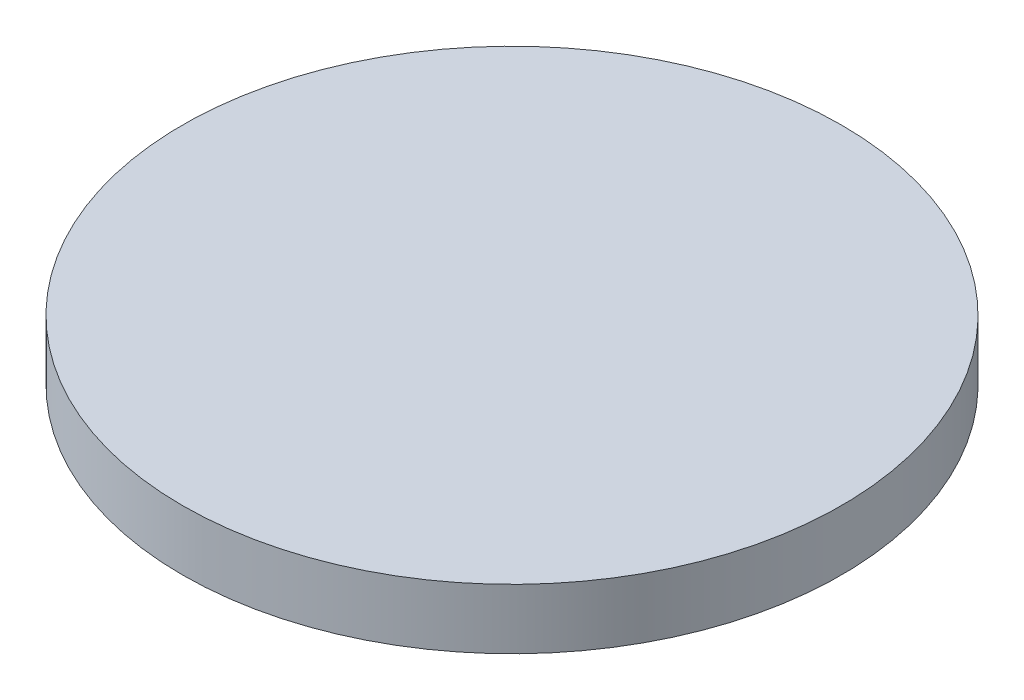
ISO-10303-21;
HEADER;
FILE_DESCRIPTION(('STEP AP214'),'2;1');
FILE_NAME('part.step','',(''),(''),'','','');
FILE_SCHEMA(('AUTOMOTIVE_DESIGN { 1 0 10303 214 1 1 1 1 }'));
ENDSEC;
DATA;
#1=APPLICATION_CONTEXT('core data for automotive mechanical design processes');
#2=APPLICATION_PROTOCOL_DEFINITION('international standard','automotive_design',2000,#1);
#3=PRODUCT_CONTEXT('',#1,'mechanical');
#4=PRODUCT('Part','Part','',(#3));
#5=PRODUCT_RELATED_PRODUCT_CATEGORY('part','',(#4));
#6=PRODUCT_DEFINITION_FORMATION('','',#4);
#7=PRODUCT_DEFINITION_CONTEXT('part definition',#1,'design');
#8=PRODUCT_DEFINITION('design','',#6,#7);
#9=PRODUCT_DEFINITION_SHAPE('','',#8);
#10=(LENGTH_UNIT() NAMED_UNIT(*) SI_UNIT(.MILLI.,.METRE.));
#11=(NAMED_UNIT(*) PLANE_ANGLE_UNIT() SI_UNIT($,.RADIAN.));
#12=(NAMED_UNIT(*) SI_UNIT($,.STERADIAN.) SOLID_ANGLE_UNIT());
#13=UNCERTAINTY_MEASURE_WITH_UNIT(LENGTH_MEASURE(1.E-05),#10,'distance_accuracy_value','');
#14=(GEOMETRIC_REPRESENTATION_CONTEXT(3) GLOBAL_UNCERTAINTY_ASSIGNED_CONTEXT((#13)) GLOBAL_UNIT_ASSIGNED_CONTEXT((#10,
#11,#12)) REPRESENTATION_CONTEXT('',''));
#15=CARTESIAN_POINT('',(0.,0.,0.));
#16=DIRECTION('',(0.,0.,1.));
#17=DIRECTION('',(1.,0.,0.));
#18=AXIS2_PLACEMENT_3D('',#15,#16,#17);
#19=CARTESIAN_POINT('',(0.,60.,0.));
#20=DIRECTION('',(0.,-1.,0.));
#21=DIRECTION('',(0.,0.,-1.));
#22=AXIS2_PLACEMENT_3D('',#19,#20,#21);
#23=CYLINDRICAL_SURFACE('',#22,164.446208637534);
#24=CARTESIAN_POINT('',(0.,60.,0.));
#25=DIRECTION('',(0.,1.,0.));
#26=DIRECTION('',(0.,0.,1.));
#27=AXIS2_PLACEMENT_3D('',#24,#25,#26);
#28=CIRCLE('',#27,164.446208637534);
#29=CARTESIAN_POINT('',(0.,60.,164.446208637534));
#30=VERTEX_POINT('',#29);
#31=EDGE_CURVE('E10',#30,#30,#28,.T.);
#32=ORIENTED_EDGE('',*,*,#31,.F.);
#33=EDGE_LOOP('',(#32));
#34=FACE_BOUND('',#33,.T.);
#35=CARTESIAN_POINT('',(0.,30.,0.));
#36=DIRECTION('',(0.,1.,0.));
#37=DIRECTION('',(0.,0.,1.));
#38=AXIS2_PLACEMENT_3D('',#35,#36,#37);
#39=CIRCLE('',#38,164.446208637534);
#40=CARTESIAN_POINT('',(0.,30.,164.446208637534));
#41=VERTEX_POINT('',#40);
#42=EDGE_CURVE('E34',#41,#41,#39,.T.);
#43=ORIENTED_EDGE('',*,*,#42,.T.);
#44=EDGE_LOOP('',(#43));
#45=FACE_BOUND('',#44,.T.);
#46=ADVANCED_FACE('F31',(#34,#45),#23,.T.);
#47=CARTESIAN_POINT('',(0.,60.,0.));
#48=DIRECTION('',(0.,1.,0.));
#49=DIRECTION('',(0.,0.,1.));
#50=AXIS2_PLACEMENT_3D('',#47,#48,#49);
#51=PLANE('',#50);
#52=ORIENTED_EDGE('',*,*,#31,.T.);
#53=EDGE_LOOP('',(#52));
#54=FACE_BOUND('',#53,.T.);
#55=ADVANCED_FACE('F46',(#54),#51,.T.);
#56=CARTESIAN_POINT('',(0.,30.,0.));
#57=DIRECTION('',(0.,1.,0.));
#58=DIRECTION('',(0.,0.,1.));
#59=AXIS2_PLACEMENT_3D('',#56,#57,#58);
#60=PLANE('',#59);
#61=ORIENTED_EDGE('',*,*,#42,.F.);
#62=EDGE_LOOP('',(#61));
#63=FACE_BOUND('',#62,.T.);
#64=ADVANCED_FACE('F44',(#63),#60,.F.);
#65=CLOSED_SHELL('',(#46,#55,#64));
#66=MANIFOLD_SOLID_BREP('B2',#65);
#67=ADVANCED_BREP_SHAPE_REPRESENTATION('',(#18,#66),#14);
#68=SHAPE_DEFINITION_REPRESENTATION(#9,#67);
ENDSEC;
END-ISO-10303-21;
